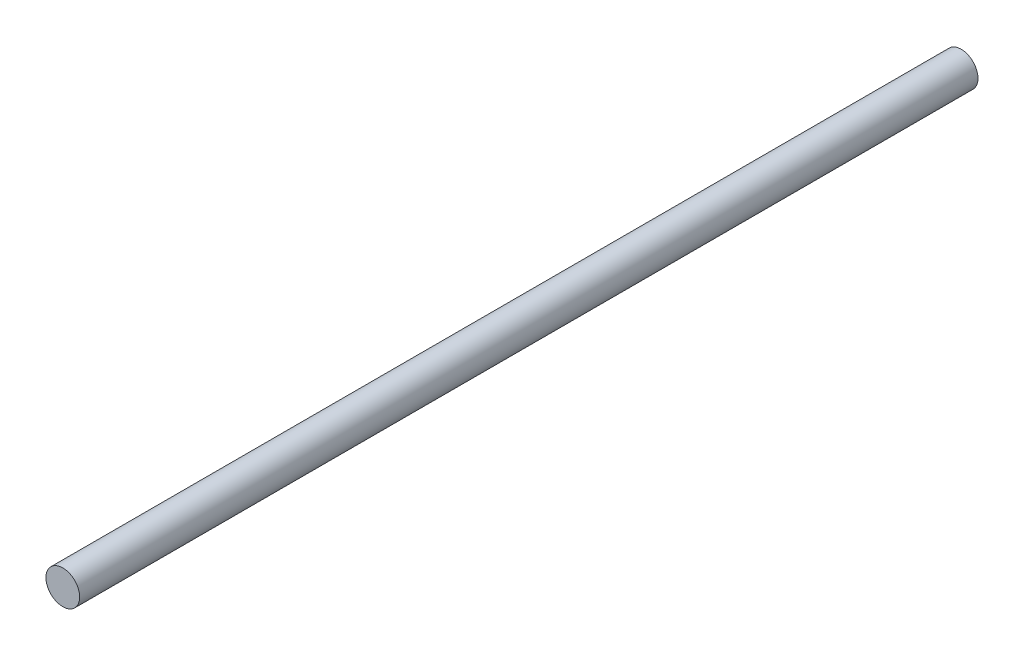
ISO-10303-21;
HEADER;
FILE_DESCRIPTION(('STEP AP214'),'2;1');
FILE_NAME('part.step','',(''),(''),'','','');
FILE_SCHEMA(('AUTOMOTIVE_DESIGN { 1 0 10303 214 1 1 1 1 }'));
ENDSEC;
DATA;
#1=APPLICATION_CONTEXT('core data for automotive mechanical design processes');
#2=APPLICATION_PROTOCOL_DEFINITION('international standard','automotive_design',2000,#1);
#3=PRODUCT_CONTEXT('',#1,'mechanical');
#4=PRODUCT('Part','Part','',(#3));
#5=PRODUCT_RELATED_PRODUCT_CATEGORY('part','',(#4));
#6=PRODUCT_DEFINITION_FORMATION('','',#4);
#7=PRODUCT_DEFINITION_CONTEXT('part definition',#1,'design');
#8=PRODUCT_DEFINITION('design','',#6,#7);
#9=PRODUCT_DEFINITION_SHAPE('','',#8);
#10=(LENGTH_UNIT() NAMED_UNIT(*) SI_UNIT(.MILLI.,.METRE.));
#11=(NAMED_UNIT(*) PLANE_ANGLE_UNIT() SI_UNIT($,.RADIAN.));
#12=(NAMED_UNIT(*) SI_UNIT($,.STERADIAN.) SOLID_ANGLE_UNIT());
#13=UNCERTAINTY_MEASURE_WITH_UNIT(LENGTH_MEASURE(1.E-05),#10,'distance_accuracy_value','');
#14=(GEOMETRIC_REPRESENTATION_CONTEXT(3) GLOBAL_UNCERTAINTY_ASSIGNED_CONTEXT((#13)) GLOBAL_UNIT_ASSIGNED_CONTEXT((#10,
#11,#12)) REPRESENTATION_CONTEXT('',''));
#15=CARTESIAN_POINT('',(0.,0.,0.));
#16=DIRECTION('',(0.,0.,1.));
#17=DIRECTION('',(1.,0.,0.));
#18=AXIS2_PLACEMENT_3D('',#15,#16,#17);
#19=CARTESIAN_POINT('',(0.,0.,800.));
#20=DIRECTION('',(0.,0.,-1.));
#21=DIRECTION('',(-1.,0.,0.));
#22=AXIS2_PLACEMENT_3D('',#19,#20,#21);
#23=CYLINDRICAL_SURFACE('',#22,15.);
#24=CARTESIAN_POINT('',(0.,0.,800.));
#25=DIRECTION('',(0.,0.,1.));
#26=DIRECTION('',(1.,0.,0.));
#27=AXIS2_PLACEMENT_3D('',#24,#25,#26);
#28=CIRCLE('',#27,15.);
#29=CARTESIAN_POINT('',(15.,0.,800.));
#30=VERTEX_POINT('',#29);
#31=EDGE_CURVE('E10',#30,#30,#28,.T.);
#32=ORIENTED_EDGE('',*,*,#31,.F.);
#33=EDGE_LOOP('',(#32));
#34=FACE_BOUND('',#33,.T.);
#35=CARTESIAN_POINT('',(0.,0.,0.));
#36=DIRECTION('',(0.,0.,1.));
#37=DIRECTION('',(1.,0.,0.));
#38=AXIS2_PLACEMENT_3D('',#35,#36,#37);
#39=CIRCLE('',#38,15.);
#40=CARTESIAN_POINT('',(15.,0.,0.));
#41=VERTEX_POINT('',#40);
#42=EDGE_CURVE('E40',#41,#41,#39,.T.);
#43=ORIENTED_EDGE('',*,*,#42,.T.);
#44=EDGE_LOOP('',(#43));
#45=FACE_BOUND('',#44,.T.);
#46=ADVANCED_FACE('F37',(#34,#45),#23,.T.);
#47=CARTESIAN_POINT('',(0.,0.,800.));
#48=DIRECTION('',(0.,0.,1.));
#49=DIRECTION('',(1.,0.,0.));
#50=AXIS2_PLACEMENT_3D('',#47,#48,#49);
#51=PLANE('',#50);
#52=ORIENTED_EDGE('',*,*,#31,.T.);
#53=EDGE_LOOP('',(#52));
#54=FACE_BOUND('',#53,.T.);
#55=ADVANCED_FACE('F54',(#54),#51,.T.);
#56=CARTESIAN_POINT('',(0.,0.,0.));
#57=DIRECTION('',(0.,0.,1.));
#58=DIRECTION('',(1.,0.,0.));
#59=AXIS2_PLACEMENT_3D('',#56,#57,#58);
#60=PLANE('',#59);
#61=ORIENTED_EDGE('',*,*,#42,.F.);
#62=EDGE_LOOP('',(#61));
#63=FACE_BOUND('',#62,.T.);
#64=ADVANCED_FACE('F52',(#63),#60,.F.);
#65=CLOSED_SHELL('',(#46,#55,#64));
#66=MANIFOLD_SOLID_BREP('B2',#65);
#67=ADVANCED_BREP_SHAPE_REPRESENTATION('',(#18,#66),#14);
#68=SHAPE_DEFINITION_REPRESENTATION(#9,#67);
ENDSEC;
END-ISO-10303-21;
